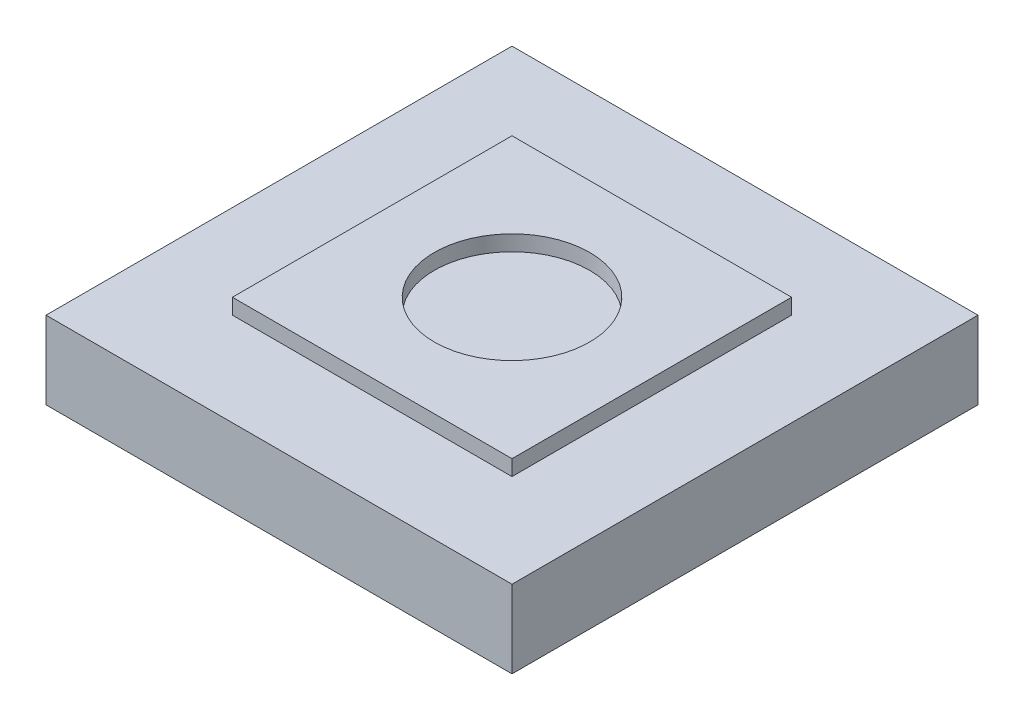
ISO-10303-21;
HEADER;
FILE_DESCRIPTION(('STEP AP214'),'2;1');
FILE_NAME('part.step','',(''),(''),'','','');
FILE_SCHEMA(('AUTOMOTIVE_DESIGN { 1 0 10303 214 1 1 1 1 }'));
ENDSEC;
DATA;
#1=APPLICATION_CONTEXT('core data for automotive mechanical design processes');
#2=APPLICATION_PROTOCOL_DEFINITION('international standard','automotive_design',2000,#1);
#3=PRODUCT_CONTEXT('',#1,'mechanical');
#4=PRODUCT('Part','Part','',(#3));
#5=PRODUCT_RELATED_PRODUCT_CATEGORY('part','',(#4));
#6=PRODUCT_DEFINITION_FORMATION('','',#4);
#7=PRODUCT_DEFINITION_CONTEXT('part definition',#1,'design');
#8=PRODUCT_DEFINITION('design','',#6,#7);
#9=PRODUCT_DEFINITION_SHAPE('','',#8);
#10=(LENGTH_UNIT() NAMED_UNIT(*) SI_UNIT(.MILLI.,.METRE.));
#11=(NAMED_UNIT(*) PLANE_ANGLE_UNIT() SI_UNIT($,.RADIAN.));
#12=(NAMED_UNIT(*) SI_UNIT($,.STERADIAN.) SOLID_ANGLE_UNIT());
#13=UNCERTAINTY_MEASURE_WITH_UNIT(LENGTH_MEASURE(1.E-05),#10,'distance_accuracy_value','');
#14=(GEOMETRIC_REPRESENTATION_CONTEXT(3) GLOBAL_UNCERTAINTY_ASSIGNED_CONTEXT((#13)) GLOBAL_UNIT_ASSIGNED_CONTEXT((#10,
#11,#12)) REPRESENTATION_CONTEXT('',''));
#15=CARTESIAN_POINT('',(0.,0.,0.));
#16=DIRECTION('',(0.,0.,1.));
#17=DIRECTION('',(1.,0.,0.));
#18=AXIS2_PLACEMENT_3D('',#15,#16,#17);
#19=CARTESIAN_POINT('',(0.,2.54,0.));
#20=DIRECTION('',(0.,-1.,0.));
#21=DIRECTION('',(0.,0.,-1.));
#22=AXIS2_PLACEMENT_3D('',#19,#20,#21);
#23=PLANE('',#22);
#24=DIRECTION('',(0.,0.,1.));
#25=VECTOR('',#24,1.);
#26=CARTESIAN_POINT('',(0.,2.54,0.));
#27=LINE('',#26,#25);
#28=CARTESIAN_POINT('',(0.,2.54,-15.24));
#29=VERTEX_POINT('',#28);
#30=CARTESIAN_POINT('',(0.,2.54,0.));
#31=VERTEX_POINT('',#30);
#32=EDGE_CURVE('E132',#29,#31,#27,.T.);
#33=ORIENTED_EDGE('',*,*,#32,.T.);
#34=DIRECTION('',(1.,0.,0.));
#35=VECTOR('',#34,1.);
#36=CARTESIAN_POINT('',(0.,2.54,0.));
#37=LINE('',#36,#35);
#38=CARTESIAN_POINT('',(15.24,2.54,0.));
#39=VERTEX_POINT('',#38);
#40=EDGE_CURVE('E135',#31,#39,#37,.T.);
#41=ORIENTED_EDGE('',*,*,#40,.T.);
#42=DIRECTION('',(0.,0.,-1.));
#43=VECTOR('',#42,1.);
#44=CARTESIAN_POINT('',(15.24,2.54,0.));
#45=LINE('',#44,#43);
#46=CARTESIAN_POINT('',(15.24,2.54,-15.24));
#47=VERTEX_POINT('',#46);
#48=EDGE_CURVE('E138',#39,#47,#45,.T.);
#49=ORIENTED_EDGE('',*,*,#48,.T.);
#50=DIRECTION('',(-1.,0.,0.));
#51=VECTOR('',#50,1.);
#52=CARTESIAN_POINT('',(0.,2.54,-15.24));
#53=LINE('',#52,#51);
#54=EDGE_CURVE('E140',#47,#29,#53,.T.);
#55=ORIENTED_EDGE('',*,*,#54,.T.);
#56=EDGE_LOOP('',(#33,#41,#49,#55));
#57=FACE_BOUND('',#56,.T.);
#58=DIRECTION('',(0.,0.,1.));
#59=VECTOR('',#58,1.);
#60=CARTESIAN_POINT('',(3.048,2.54,0.));
#61=LINE('',#60,#59);
#62=CARTESIAN_POINT('',(3.048,2.54,-12.192));
#63=VERTEX_POINT('',#62);
#64=CARTESIAN_POINT('',(3.048,2.54,-3.048));
#65=VERTEX_POINT('',#64);
#66=EDGE_CURVE('E119',#63,#65,#61,.T.);
#67=ORIENTED_EDGE('',*,*,#66,.F.);
#68=DIRECTION('',(-1.,0.,0.));
#69=VECTOR('',#68,1.);
#70=CARTESIAN_POINT('',(0.,2.54,-12.192));
#71=LINE('',#70,#69);
#72=CARTESIAN_POINT('',(12.192,2.54,-12.192));
#73=VERTEX_POINT('',#72);
#74=EDGE_CURVE('E120',#73,#63,#71,.T.);
#75=ORIENTED_EDGE('',*,*,#74,.F.);
#76=DIRECTION('',(0.,0.,-1.));
#77=VECTOR('',#76,1.);
#78=CARTESIAN_POINT('',(12.192,2.54,0.));
#79=LINE('',#78,#77);
#80=CARTESIAN_POINT('',(12.192,2.54,-3.048));
#81=VERTEX_POINT('',#80);
#82=EDGE_CURVE('E54',#81,#73,#79,.T.);
#83=ORIENTED_EDGE('',*,*,#82,.F.);
#84=DIRECTION('',(1.,0.,0.));
#85=VECTOR('',#84,1.);
#86=CARTESIAN_POINT('',(0.,2.54,-3.048));
#87=LINE('',#86,#85);
#88=EDGE_CURVE('E49',#65,#81,#87,.T.);
#89=ORIENTED_EDGE('',*,*,#88,.F.);
#90=EDGE_LOOP('',(#67,#75,#83,#89));
#91=FACE_BOUND('',#90,.T.);
#92=ADVANCED_FACE('F34',(#57,#91),#23,.F.);
#93=CARTESIAN_POINT('',(0.,2.54,0.));
#94=DIRECTION('',(1.,0.,0.));
#95=DIRECTION('',(0.,0.,-1.));
#96=AXIS2_PLACEMENT_3D('',#93,#94,#95);
#97=PLANE('',#96);
#98=DIRECTION('',(0.,0.,1.));
#99=VECTOR('',#98,1.);
#100=CARTESIAN_POINT('',(0.,0.,0.));
#101=LINE('',#100,#99);
#102=CARTESIAN_POINT('',(0.,0.,-15.24));
#103=VERTEX_POINT('',#102);
#104=CARTESIAN_POINT('',(0.,0.,0.));
#105=VERTEX_POINT('',#104);
#106=EDGE_CURVE('E131',#103,#105,#101,.T.);
#107=ORIENTED_EDGE('',*,*,#106,.T.);
#108=DIRECTION('',(0.,-1.,0.));
#109=VECTOR('',#108,1.);
#110=CARTESIAN_POINT('',(0.,2.54,0.));
#111=LINE('',#110,#109);
#112=EDGE_CURVE('E11',#31,#105,#111,.T.);
#113=ORIENTED_EDGE('',*,*,#112,.F.);
#114=ORIENTED_EDGE('',*,*,#32,.F.);
#115=DIRECTION('',(0.,-1.,0.));
#116=VECTOR('',#115,1.);
#117=CARTESIAN_POINT('',(0.,2.54,-15.24));
#118=LINE('',#117,#116);
#119=EDGE_CURVE('E142',#29,#103,#118,.T.);
#120=ORIENTED_EDGE('',*,*,#119,.T.);
#121=EDGE_LOOP('',(#107,#113,#114,#120));
#122=FACE_BOUND('',#121,.T.);
#123=ADVANCED_FACE('F36',(#122),#97,.F.);
#124=CARTESIAN_POINT('',(0.,2.54,0.));
#125=DIRECTION('',(0.,0.,-1.));
#126=DIRECTION('',(-1.,0.,0.));
#127=AXIS2_PLACEMENT_3D('',#124,#125,#126);
#128=PLANE('',#127);
#129=DIRECTION('',(1.,0.,0.));
#130=VECTOR('',#129,1.);
#131=CARTESIAN_POINT('',(0.,0.,0.));
#132=LINE('',#131,#130);
#133=CARTESIAN_POINT('',(15.24,0.,0.));
#134=VERTEX_POINT('',#133);
#135=EDGE_CURVE('E145',#105,#134,#132,.T.);
#136=ORIENTED_EDGE('',*,*,#135,.T.);
#137=DIRECTION('',(0.,-1.,0.));
#138=VECTOR('',#137,1.);
#139=CARTESIAN_POINT('',(15.24,2.54,0.));
#140=LINE('',#139,#138);
#141=EDGE_CURVE('E42',#39,#134,#140,.T.);
#142=ORIENTED_EDGE('',*,*,#141,.F.);
#143=ORIENTED_EDGE('',*,*,#40,.F.);
#144=ORIENTED_EDGE('',*,*,#112,.T.);
#145=EDGE_LOOP('',(#136,#142,#143,#144));
#146=FACE_BOUND('',#145,.T.);
#147=ADVANCED_FACE('F174',(#146),#128,.F.);
#148=CARTESIAN_POINT('',(15.24,2.54,0.));
#149=DIRECTION('',(-1.,0.,0.));
#150=DIRECTION('',(0.,0.,1.));
#151=AXIS2_PLACEMENT_3D('',#148,#149,#150);
#152=PLANE('',#151);
#153=DIRECTION('',(0.,0.,-1.));
#154=VECTOR('',#153,1.);
#155=CARTESIAN_POINT('',(15.24,0.,0.));
#156=LINE('',#155,#154);
#157=CARTESIAN_POINT('',(15.24,0.,-15.24));
#158=VERTEX_POINT('',#157);
#159=EDGE_CURVE('E147',#134,#158,#156,.T.);
#160=ORIENTED_EDGE('',*,*,#159,.T.);
#161=DIRECTION('',(0.,-1.,0.));
#162=VECTOR('',#161,1.);
#163=CARTESIAN_POINT('',(15.24,2.54,-15.24));
#164=LINE('',#163,#162);
#165=EDGE_CURVE('E152',#47,#158,#164,.T.);
#166=ORIENTED_EDGE('',*,*,#165,.F.);
#167=ORIENTED_EDGE('',*,*,#48,.F.);
#168=ORIENTED_EDGE('',*,*,#141,.T.);
#169=EDGE_LOOP('',(#160,#166,#167,#168));
#170=FACE_BOUND('',#169,.T.);
#171=ADVANCED_FACE('F159',(#170),#152,.F.);
#172=CARTESIAN_POINT('',(0.,2.54,-15.24));
#173=DIRECTION('',(0.,0.,1.));
#174=DIRECTION('',(1.,0.,0.));
#175=AXIS2_PLACEMENT_3D('',#172,#173,#174);
#176=PLANE('',#175);
#177=DIRECTION('',(-1.,0.,0.));
#178=VECTOR('',#177,1.);
#179=CARTESIAN_POINT('',(0.,0.,-15.24));
#180=LINE('',#179,#178);
#181=EDGE_CURVE('E136',#158,#103,#180,.T.);
#182=ORIENTED_EDGE('',*,*,#181,.T.);
#183=ORIENTED_EDGE('',*,*,#119,.F.);
#184=ORIENTED_EDGE('',*,*,#54,.F.);
#185=ORIENTED_EDGE('',*,*,#165,.T.);
#186=EDGE_LOOP('',(#182,#183,#184,#185));
#187=FACE_BOUND('',#186,.T.);
#188=ADVANCED_FACE('F168',(#187),#176,.F.);
#189=CARTESIAN_POINT('',(0.,0.,0.));
#190=DIRECTION('',(0.,-1.,0.));
#191=DIRECTION('',(0.,0.,-1.));
#192=AXIS2_PLACEMENT_3D('',#189,#190,#191);
#193=PLANE('',#192);
#194=ORIENTED_EDGE('',*,*,#106,.F.);
#195=ORIENTED_EDGE('',*,*,#181,.F.);
#196=ORIENTED_EDGE('',*,*,#159,.F.);
#197=ORIENTED_EDGE('',*,*,#135,.F.);
#198=EDGE_LOOP('',(#194,#195,#196,#197));
#199=FACE_BOUND('',#198,.T.);
#200=ADVANCED_FACE('F165',(#199),#193,.T.);
#201=CARTESIAN_POINT('',(3.048,3.048,-12.192));
#202=DIRECTION('',(1.,0.,0.));
#203=DIRECTION('',(0.,0.,-1.));
#204=AXIS2_PLACEMENT_3D('',#201,#202,#203);
#205=PLANE('',#204);
#206=DIRECTION('',(0.,-1.,0.));
#207=VECTOR('',#206,1.);
#208=CARTESIAN_POINT('',(3.048,3.048,-12.192));
#209=LINE('',#208,#207);
#210=CARTESIAN_POINT('',(3.048,3.048,-12.192));
#211=VERTEX_POINT('',#210);
#212=EDGE_CURVE('E295',#211,#63,#209,.T.);
#213=ORIENTED_EDGE('',*,*,#212,.T.);
#214=ORIENTED_EDGE('',*,*,#66,.T.);
#215=DIRECTION('',(0.,-1.,0.));
#216=VECTOR('',#215,1.);
#217=CARTESIAN_POINT('',(3.048,3.048,-3.048));
#218=LINE('',#217,#216);
#219=CARTESIAN_POINT('',(3.048,3.048,-3.048));
#220=VERTEX_POINT('',#219);
#221=EDGE_CURVE('E101',#220,#65,#218,.T.);
#222=ORIENTED_EDGE('',*,*,#221,.F.);
#223=DIRECTION('',(0.,0.,1.));
#224=VECTOR('',#223,1.);
#225=CARTESIAN_POINT('',(3.048,3.048,-12.192));
#226=LINE('',#225,#224);
#227=EDGE_CURVE('E107',#211,#220,#226,.T.);
#228=ORIENTED_EDGE('',*,*,#227,.F.);
#229=EDGE_LOOP('',(#213,#214,#222,#228));
#230=FACE_BOUND('',#229,.T.);
#231=ADVANCED_FACE('F118',(#230),#205,.F.);
#232=CARTESIAN_POINT('',(3.048,3.048,-3.048));
#233=DIRECTION('',(0.,0.,-1.));
#234=DIRECTION('',(-1.,0.,0.));
#235=AXIS2_PLACEMENT_3D('',#232,#233,#234);
#236=PLANE('',#235);
#237=ORIENTED_EDGE('',*,*,#221,.T.);
#238=ORIENTED_EDGE('',*,*,#88,.T.);
#239=DIRECTION('',(0.,-1.,0.));
#240=VECTOR('',#239,1.);
#241=CARTESIAN_POINT('',(12.192,3.048,-3.048));
#242=LINE('',#241,#240);
#243=CARTESIAN_POINT('',(12.192,3.048,-3.048));
#244=VERTEX_POINT('',#243);
#245=EDGE_CURVE('E103',#244,#81,#242,.T.);
#246=ORIENTED_EDGE('',*,*,#245,.F.);
#247=DIRECTION('',(1.,0.,0.));
#248=VECTOR('',#247,1.);
#249=CARTESIAN_POINT('',(3.048,3.048,-3.048));
#250=LINE('',#249,#248);
#251=EDGE_CURVE('E97',#220,#244,#250,.T.);
#252=ORIENTED_EDGE('',*,*,#251,.F.);
#253=EDGE_LOOP('',(#237,#238,#246,#252));
#254=FACE_BOUND('',#253,.T.);
#255=ADVANCED_FACE('F99',(#254),#236,.F.);
#256=CARTESIAN_POINT('',(12.192,3.048,-12.192));
#257=DIRECTION('',(-1.,0.,0.));
#258=DIRECTION('',(0.,0.,1.));
#259=AXIS2_PLACEMENT_3D('',#256,#257,#258);
#260=PLANE('',#259);
#261=ORIENTED_EDGE('',*,*,#245,.T.);
#262=ORIENTED_EDGE('',*,*,#82,.T.);
#263=DIRECTION('',(0.,-1.,0.));
#264=VECTOR('',#263,1.);
#265=CARTESIAN_POINT('',(12.192,3.048,-12.192));
#266=LINE('',#265,#264);
#267=CARTESIAN_POINT('',(12.192,3.048,-12.192));
#268=VERTEX_POINT('',#267);
#269=EDGE_CURVE('E124',#268,#73,#266,.T.);
#270=ORIENTED_EDGE('',*,*,#269,.F.);
#271=DIRECTION('',(0.,0.,-1.));
#272=VECTOR('',#271,1.);
#273=CARTESIAN_POINT('',(12.192,3.048,-12.192));
#274=LINE('',#273,#272);
#275=EDGE_CURVE('E106',#244,#268,#274,.T.);
#276=ORIENTED_EDGE('',*,*,#275,.F.);
#277=EDGE_LOOP('',(#261,#262,#270,#276));
#278=FACE_BOUND('',#277,.T.);
#279=ADVANCED_FACE('F210',(#278),#260,.F.);
#280=CARTESIAN_POINT('',(3.048,3.048,-12.192));
#281=DIRECTION('',(0.,0.,1.));
#282=DIRECTION('',(1.,0.,0.));
#283=AXIS2_PLACEMENT_3D('',#280,#281,#282);
#284=PLANE('',#283);
#285=ORIENTED_EDGE('',*,*,#269,.T.);
#286=ORIENTED_EDGE('',*,*,#74,.T.);
#287=ORIENTED_EDGE('',*,*,#212,.F.);
#288=DIRECTION('',(-1.,0.,0.));
#289=VECTOR('',#288,1.);
#290=CARTESIAN_POINT('',(3.048,3.048,-12.192));
#291=LINE('',#290,#289);
#292=EDGE_CURVE('E112',#268,#211,#291,.T.);
#293=ORIENTED_EDGE('',*,*,#292,.F.);
#294=EDGE_LOOP('',(#285,#286,#287,#293));
#295=FACE_BOUND('',#294,.T.);
#296=ADVANCED_FACE('F216',(#295),#284,.F.);
#297=CARTESIAN_POINT('',(0.,3.048,0.));
#298=DIRECTION('',(0.,1.,0.));
#299=DIRECTION('',(0.,0.,1.));
#300=AXIS2_PLACEMENT_3D('',#297,#298,#299);
#301=PLANE('',#300);
#302=CARTESIAN_POINT('',(7.62,3.048,-7.62));
#303=DIRECTION('',(0.,1.,0.));
#304=DIRECTION('',(0.,0.,1.));
#305=AXIS2_PLACEMENT_3D('',#302,#303,#304);
#306=CIRCLE('',#305,2.54);
#307=CARTESIAN_POINT('',(7.62,3.048,-5.08));
#308=VERTEX_POINT('',#307);
#309=EDGE_CURVE('E288',#308,#308,#306,.T.);
#310=ORIENTED_EDGE('',*,*,#309,.F.);
#311=EDGE_LOOP('',(#310));
#312=FACE_BOUND('',#311,.T.);
#313=ORIENTED_EDGE('',*,*,#227,.T.);
#314=ORIENTED_EDGE('',*,*,#251,.T.);
#315=ORIENTED_EDGE('',*,*,#275,.T.);
#316=ORIENTED_EDGE('',*,*,#292,.T.);
#317=EDGE_LOOP('',(#313,#314,#315,#316));
#318=FACE_BOUND('',#317,.T.);
#319=ADVANCED_FACE('F110',(#312,#318),#301,.T.);
#320=CARTESIAN_POINT('',(7.62,2.54,-7.62));
#321=DIRECTION('',(0.,1.,0.));
#322=DIRECTION('',(0.,0.,1.));
#323=AXIS2_PLACEMENT_3D('',#320,#321,#322);
#324=CYLINDRICAL_SURFACE('',#323,2.54);
#325=CARTESIAN_POINT('',(7.62,2.54,-7.62));
#326=DIRECTION('',(0.,1.,0.));
#327=DIRECTION('',(0.,0.,1.));
#328=AXIS2_PLACEMENT_3D('',#325,#326,#327);
#329=CIRCLE('',#328,2.54);
#330=CARTESIAN_POINT('',(7.62,2.54,-5.08));
#331=VERTEX_POINT('',#330);
#332=EDGE_CURVE('E116',#331,#331,#329,.T.);
#333=ORIENTED_EDGE('',*,*,#332,.F.);
#334=EDGE_LOOP('',(#333));
#335=FACE_BOUND('',#334,.T.);
#336=ORIENTED_EDGE('',*,*,#309,.T.);
#337=EDGE_LOOP('',(#336));
#338=FACE_BOUND('',#337,.T.);
#339=ADVANCED_FACE('F231',(#335,#338),#324,.F.);
#340=CARTESIAN_POINT('',(7.62,2.54,-7.62));
#341=DIRECTION('',(0.,1.,0.));
#342=DIRECTION('',(0.,0.,1.));
#343=AXIS2_PLACEMENT_3D('',#340,#341,#342);
#344=PLANE('',#343);
#345=ORIENTED_EDGE('',*,*,#332,.T.);
#346=EDGE_LOOP('',(#345));
#347=FACE_BOUND('',#346,.T.);
#348=ADVANCED_FACE('F239',(#347),#344,.T.);
#349=CLOSED_SHELL('',(#92,#123,#147,#171,#188,#200,#231,#255,#279,#296,#319,#339,#348));
#350=MANIFOLD_SOLID_BREP('B2',#349);
#351=ADVANCED_BREP_SHAPE_REPRESENTATION('',(#18,#350),#14);
#352=SHAPE_DEFINITION_REPRESENTATION(#9,#351);
ENDSEC;
END-ISO-10303-21;
